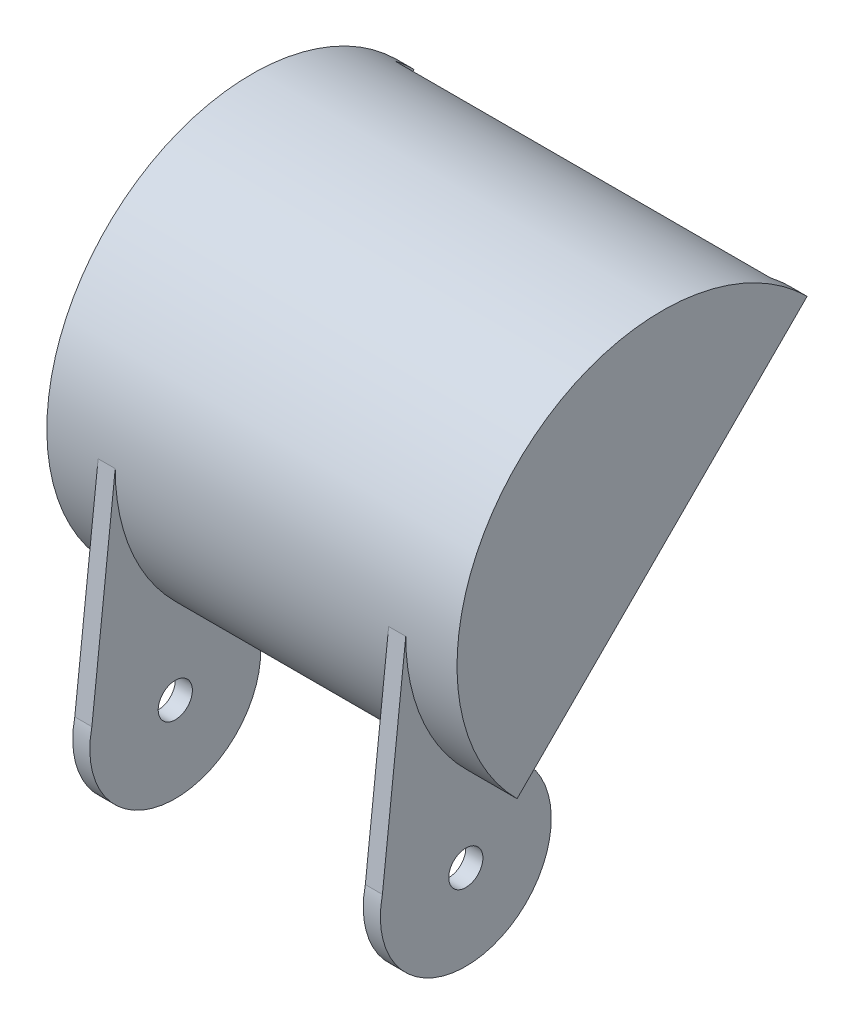
ISO-10303-21;
HEADER;
FILE_DESCRIPTION(('STEP AP214'),'2;1');
FILE_NAME('part.step','',(''),(''),'','','');
FILE_SCHEMA(('AUTOMOTIVE_DESIGN { 1 0 10303 214 1 1 1 1 }'));
ENDSEC;
DATA;
#1=APPLICATION_CONTEXT('core data for automotive mechanical design processes');
#2=APPLICATION_PROTOCOL_DEFINITION('international standard','automotive_design',2000,#1);
#3=PRODUCT_CONTEXT('',#1,'mechanical');
#4=PRODUCT('Part','Part','',(#3));
#5=PRODUCT_RELATED_PRODUCT_CATEGORY('part','',(#4));
#6=PRODUCT_DEFINITION_FORMATION('','',#4);
#7=PRODUCT_DEFINITION_CONTEXT('part definition',#1,'design');
#8=PRODUCT_DEFINITION('design','',#6,#7);
#9=PRODUCT_DEFINITION_SHAPE('','',#8);
#10=(LENGTH_UNIT() NAMED_UNIT(*) SI_UNIT(.MILLI.,.METRE.));
#11=(NAMED_UNIT(*) PLANE_ANGLE_UNIT() SI_UNIT($,.RADIAN.));
#12=(NAMED_UNIT(*) SI_UNIT($,.STERADIAN.) SOLID_ANGLE_UNIT());
#13=UNCERTAINTY_MEASURE_WITH_UNIT(LENGTH_MEASURE(1.E-05),#10,'distance_accuracy_value','');
#14=(GEOMETRIC_REPRESENTATION_CONTEXT(3) GLOBAL_UNCERTAINTY_ASSIGNED_CONTEXT((#13)) GLOBAL_UNIT_ASSIGNED_CONTEXT((#10,
#11,#12)) REPRESENTATION_CONTEXT('',''));
#15=CARTESIAN_POINT('',(0.,0.,0.));
#16=DIRECTION('',(0.,0.,1.));
#17=DIRECTION('',(1.,0.,0.));
#18=AXIS2_PLACEMENT_3D('',#15,#16,#17);
#19=CARTESIAN_POINT('',(28.575,2.24506403026729,-2.24506403026728));
#20=DIRECTION('',(0.,0.,1.));
#21=DIRECTION('',(1.,0.,0.));
#22=AXIS2_PLACEMENT_3D('',#19,#20,#21);
#23=PLANE('',#22);
#24=DIRECTION('',(0.,1.,0.));
#25=VECTOR('',#24,1.);
#26=CARTESIAN_POINT('',(-25.4,-0.15955178812898,-2.24506403026728));
#27=LINE('',#26,#25);
#28=CARTESIAN_POINT('',(-25.4,-0.15955178812898,-2.24506403026728));
#29=VERTEX_POINT('',#28);
#30=CARTESIAN_POINT('',(-25.4,2.24506403026729,-2.24506403026728));
#31=VERTEX_POINT('',#30);
#32=EDGE_CURVE('E157',#29,#31,#27,.T.);
#33=ORIENTED_EDGE('',*,*,#32,.F.);
#34=DIRECTION('',(-1.,0.,0.));
#35=VECTOR('',#34,1.);
#36=CARTESIAN_POINT('',(28.575,-0.15955178812898,-2.24506403026728));
#37=LINE('',#36,#35);
#38=CARTESIAN_POINT('',(-28.575,-0.15955178812898,-2.24506403026728));
#39=VERTEX_POINT('',#38);
#40=EDGE_CURVE('E167',#29,#39,#37,.T.);
#41=ORIENTED_EDGE('',*,*,#40,.T.);
#42=DIRECTION('',(0.,1.,0.));
#43=VECTOR('',#42,1.);
#44=CARTESIAN_POINT('',(-28.575,2.24506403026729,-2.24506403026728));
#45=LINE('',#44,#43);
#46=CARTESIAN_POINT('',(-28.575,2.24506403026729,-2.24506403026728));
#47=VERTEX_POINT('',#46);
#48=EDGE_CURVE('E352',#39,#47,#45,.T.);
#49=ORIENTED_EDGE('',*,*,#48,.T.);
#50=DIRECTION('',(-1.,0.,0.));
#51=VECTOR('',#50,1.);
#52=CARTESIAN_POINT('',(28.575,2.24506403026729,-2.24506403026728));
#53=LINE('',#52,#51);
#54=EDGE_CURVE('E53',#31,#47,#53,.T.);
#55=ORIENTED_EDGE('',*,*,#54,.F.);
#56=EDGE_LOOP('',(#33,#41,#49,#55));
#57=FACE_BOUND('',#56,.T.);
#58=ADVANCED_FACE('F37',(#57),#23,.F.);
#59=CARTESIAN_POINT('',(-75.0672223709817,26.9407683632072,11.1592316367926));
#60=DIRECTION('',(0.,0.109478882044128,0.993989121865208));
#61=DIRECTION('',(0.,-0.993989121865208,0.109478882044128));
#62=AXIS2_PLACEMENT_3D('',#59,#60,#61);
#63=PLANE('',#62);
#64=DIRECTION('',(-1.,0.,0.));
#65=VECTOR('',#64,1.);
#66=CARTESIAN_POINT('',(28.575,-12.4199390340299,15.4944563867672));
#67=LINE('',#66,#65);
#68=CARTESIAN_POINT('',(-25.4,-12.4199390340299,15.4944563867672));
#69=VERTEX_POINT('',#68);
#70=CARTESIAN_POINT('',(-28.575,-12.4199390340299,15.4944563867672));
#71=VERTEX_POINT('',#70);
#72=EDGE_CURVE('E333',#69,#71,#67,.T.);
#73=ORIENTED_EDGE('',*,*,#72,.F.);
#74=DIRECTION('',(0.,-0.993989121865208,0.109478882044128));
#75=VECTOR('',#74,1.);
#76=CARTESIAN_POINT('',(-25.4,26.9407683632072,11.1592316367926));
#77=LINE('',#76,#75);
#78=CARTESIAN_POINT('',(-25.4,26.9407683632072,11.1592316367926));
#79=VERTEX_POINT('',#78);
#80=EDGE_CURVE('E159',#79,#69,#77,.T.);
#81=ORIENTED_EDGE('',*,*,#80,.F.);
#82=DIRECTION('',(1.,0.,0.));
#83=VECTOR('',#82,1.);
#84=CARTESIAN_POINT('',(-75.0672223709817,26.9407683632072,11.1592316367926));
#85=LINE('',#84,#83);
#86=CARTESIAN_POINT('',(-28.575,26.9407683632072,11.1592316367926));
#87=VERTEX_POINT('',#86);
#88=EDGE_CURVE('E328',#87,#79,#85,.T.);
#89=ORIENTED_EDGE('',*,*,#88,.F.);
#90=DIRECTION('',(0.,0.993989121865208,-0.109478882044128));
#91=VECTOR('',#90,1.);
#92=CARTESIAN_POINT('',(-28.575,26.9407683632072,11.1592316367926));
#93=LINE('',#92,#91);
#94=EDGE_CURVE('E330',#71,#87,#93,.T.);
#95=ORIENTED_EDGE('',*,*,#94,.F.);
#96=EDGE_LOOP('',(#73,#81,#89,#95));
#97=FACE_BOUND('',#96,.T.);
#98=ADVANCED_FACE('F267',(#97),#63,.T.);
#99=CARTESIAN_POINT('',(28.575,-15.875,0.));
#100=DIRECTION('',(-1.,0.,0.));
#101=DIRECTION('',(0.,0.,1.));
#102=AXIS2_PLACEMENT_3D('',#99,#100,#101);
#103=CYLINDRICAL_SURFACE('',#102,15.875);
#104=CARTESIAN_POINT('',(-25.4,-15.875,0.));
#105=DIRECTION('',(1.,0.,0.));
#106=DIRECTION('',(0.,0.,-1.));
#107=AXIS2_PLACEMENT_3D('',#104,#105,#106);
#108=CIRCLE('',#107,15.875);
#109=EDGE_CURVE('E11',#69,#29,#108,.T.);
#110=ORIENTED_EDGE('',*,*,#109,.F.);
#111=ORIENTED_EDGE('',*,*,#72,.T.);
#112=CARTESIAN_POINT('',(-28.575,-15.875,0.));
#113=DIRECTION('',(1.,0.,0.));
#114=DIRECTION('',(0.,0.,-1.));
#115=AXIS2_PLACEMENT_3D('',#112,#113,#114);
#116=CIRCLE('',#115,15.875);
#117=EDGE_CURVE('E174',#71,#39,#116,.T.);
#118=ORIENTED_EDGE('',*,*,#117,.T.);
#119=ORIENTED_EDGE('',*,*,#40,.F.);
#120=EDGE_LOOP('',(#110,#111,#118,#119));
#121=FACE_BOUND('',#120,.T.);
#122=ADVANCED_FACE('F172',(#121),#103,.T.);
#123=CARTESIAN_POINT('',(38.1,0.,0.));
#124=DIRECTION('',(0.,0.707106781186546,0.707106781186549));
#125=DIRECTION('',(0.,-0.707106781186549,0.707106781186546));
#126=AXIS2_PLACEMENT_3D('',#123,#124,#125);
#127=PLANE('',#126);
#128=DIRECTION('',(0.,-0.707106781186549,0.707106781186546));
#129=VECTOR('',#128,1.);
#130=CARTESIAN_POINT('',(-28.575,2.24506403026729,-2.24506403026728));
#131=LINE('',#130,#129);
#132=CARTESIAN_POINT('',(-28.575,0.,0.));
#133=VERTEX_POINT('',#132);
#134=EDGE_CURVE('E248',#47,#133,#131,.T.);
#135=ORIENTED_EDGE('',*,*,#134,.T.);
#136=DIRECTION('',(-1.,0.,0.));
#137=VECTOR('',#136,1.);
#138=CARTESIAN_POINT('',(38.1,0.,0.));
#139=LINE('',#138,#137);
#140=CARTESIAN_POINT('',(-38.1,0.,0.));
#141=VERTEX_POINT('',#140);
#142=EDGE_CURVE('E210',#133,#141,#139,.T.);
#143=ORIENTED_EDGE('',*,*,#142,.T.);
#144=DIRECTION('',(0.,0.707106781186549,-0.707106781186546));
#145=VECTOR('',#144,1.);
#146=CARTESIAN_POINT('',(-38.1,0.,0.));
#147=LINE('',#146,#145);
#148=CARTESIAN_POINT('',(-38.1,53.881536726415,-53.8815367264148));
#149=VERTEX_POINT('',#148);
#150=EDGE_CURVE('E200',#141,#149,#147,.T.);
#151=ORIENTED_EDGE('',*,*,#150,.T.);
#152=DIRECTION('',(-1.,0.,0.));
#153=VECTOR('',#152,1.);
#154=CARTESIAN_POINT('',(38.1,53.881536726415,-53.8815367264148));
#155=LINE('',#154,#153);
#156=CARTESIAN_POINT('',(-34.925,53.881536726415,-53.8815367264148));
#157=VERTEX_POINT('',#156);
#158=EDGE_CURVE('E202',#157,#149,#155,.T.);
#159=ORIENTED_EDGE('',*,*,#158,.F.);
#160=DIRECTION('',(0.,0.707106781186549,-0.707106781186546));
#161=VECTOR('',#160,1.);
#162=CARTESIAN_POINT('',(-34.925,0.,0.));
#163=LINE('',#162,#161);
#164=CARTESIAN_POINT('',(-34.925,2.24506403026729,-2.24506403026728));
#165=VERTEX_POINT('',#164);
#166=EDGE_CURVE('E186',#165,#157,#163,.T.);
#167=ORIENTED_EDGE('',*,*,#166,.F.);
#168=DIRECTION('',(-1.,0.,0.));
#169=VECTOR('',#168,1.);
#170=CARTESIAN_POINT('',(34.925,2.24506403026729,-2.24506403026728));
#171=LINE('',#170,#169);
#172=EDGE_CURVE('E193',#47,#165,#171,.T.);
#173=ORIENTED_EDGE('',*,*,#172,.F.);
#174=EDGE_LOOP('',(#135,#143,#151,#159,#167,#173));
#175=FACE_BOUND('',#174,.T.);
#176=ADVANCED_FACE('F247',(#175),#127,.F.);
#177=CARTESIAN_POINT('',(38.1,0.,0.));
#178=VERTEX_POINT('',#177);
#179=CARTESIAN_POINT('',(28.575,0.,0.));
#180=VERTEX_POINT('',#179);
#181=EDGE_CURVE('E211',#178,#180,#139,.T.);
#182=ORIENTED_EDGE('',*,*,#181,.T.);
#183=DIRECTION('',(0.,-0.707106781186549,0.707106781186546));
#184=VECTOR('',#183,1.);
#185=CARTESIAN_POINT('',(28.575,2.24506403026729,-2.24506403026728));
#186=LINE('',#185,#184);
#187=CARTESIAN_POINT('',(28.575,2.24506403026729,-2.24506403026728));
#188=VERTEX_POINT('',#187);
#189=EDGE_CURVE('E349',#188,#180,#186,.T.);
#190=ORIENTED_EDGE('',*,*,#189,.F.);
#191=CARTESIAN_POINT('',(34.925,2.24506403026729,-2.24506403026728));
#192=VERTEX_POINT('',#191);
#193=EDGE_CURVE('E189',#192,#188,#171,.T.);
#194=ORIENTED_EDGE('',*,*,#193,.F.);
#195=DIRECTION('',(0.,0.707106781186549,-0.707106781186546));
#196=VECTOR('',#195,1.);
#197=CARTESIAN_POINT('',(34.925,0.,0.));
#198=LINE('',#197,#196);
#199=CARTESIAN_POINT('',(34.925,53.881536726415,-53.8815367264148));
#200=VERTEX_POINT('',#199);
#201=EDGE_CURVE('E61',#192,#200,#198,.T.);
#202=ORIENTED_EDGE('',*,*,#201,.T.);
#203=CARTESIAN_POINT('',(38.1,53.881536726415,-53.8815367264148));
#204=VERTEX_POINT('',#203);
#205=EDGE_CURVE('E207',#204,#200,#155,.T.);
#206=ORIENTED_EDGE('',*,*,#205,.F.);
#207=DIRECTION('',(0.,0.707106781186549,-0.707106781186546));
#208=VECTOR('',#207,1.);
#209=CARTESIAN_POINT('',(38.1,0.,0.));
#210=LINE('',#209,#208);
#211=EDGE_CURVE('E199',#178,#204,#210,.T.);
#212=ORIENTED_EDGE('',*,*,#211,.F.);
#213=EDGE_LOOP('',(#182,#190,#194,#202,#206,#212));
#214=FACE_BOUND('',#213,.T.);
#215=ADVANCED_FACE('F370',(#214),#127,.F.);
#216=CARTESIAN_POINT('',(38.1,26.9407683632075,-26.9407683632074));
#217=DIRECTION('',(-1.,0.,0.));
#218=DIRECTION('',(0.,0.,1.));
#219=AXIS2_PLACEMENT_3D('',#216,#217,#218);
#220=CYLINDRICAL_SURFACE('',#219,38.1);
#221=ORIENTED_EDGE('',*,*,#88,.T.);
#222=CARTESIAN_POINT('',(-25.4,26.9407683632075,-26.9407683632074));
#223=DIRECTION('',(-1.,0.,0.));
#224=DIRECTION('',(0.,0.,-1.));
#225=AXIS2_PLACEMENT_3D('',#222,#223,#224);
#226=CIRCLE('',#225,38.1);
#227=CARTESIAN_POINT('',(-25.4,0.,0.));
#228=VERTEX_POINT('',#227);
#229=EDGE_CURVE('E359',#228,#79,#226,.T.);
#230=ORIENTED_EDGE('',*,*,#229,.F.);
#231=DIRECTION('',(1.,0.,0.));
#232=VECTOR('',#231,1.);
#233=CARTESIAN_POINT('',(-25.4,0.,0.));
#234=LINE('',#233,#232);
#235=CARTESIAN_POINT('',(25.4,0.,0.));
#236=VERTEX_POINT('',#235);
#237=EDGE_CURVE('E320',#228,#236,#234,.T.);
#238=ORIENTED_EDGE('',*,*,#237,.T.);
#239=CARTESIAN_POINT('',(25.4,26.9407683632075,-26.9407683632074));
#240=DIRECTION('',(-1.,0.,0.));
#241=DIRECTION('',(0.,0.,-1.));
#242=AXIS2_PLACEMENT_3D('',#239,#240,#241);
#243=CIRCLE('',#242,38.1);
#244=CARTESIAN_POINT('',(25.4,26.9407683632072,11.1592316367926));
#245=VERTEX_POINT('',#244);
#246=EDGE_CURVE('E313',#236,#245,#243,.T.);
#247=ORIENTED_EDGE('',*,*,#246,.T.);
#248=CARTESIAN_POINT('',(28.575,26.9407683632072,11.1592316367926));
#249=VERTEX_POINT('',#248);
#250=EDGE_CURVE('E327',#245,#249,#85,.T.);
#251=ORIENTED_EDGE('',*,*,#250,.T.);
#252=CARTESIAN_POINT('',(28.575,26.9407683632075,-26.9407683632074));
#253=DIRECTION('',(1.,0.,0.));
#254=DIRECTION('',(0.,0.,-1.));
#255=AXIS2_PLACEMENT_3D('',#252,#253,#254);
#256=CIRCLE('',#255,38.1);
#257=EDGE_CURVE('E335',#249,#180,#256,.T.);
#258=ORIENTED_EDGE('',*,*,#257,.T.);
#259=ORIENTED_EDGE('',*,*,#181,.F.);
#260=CARTESIAN_POINT('',(38.1,26.9407683632075,-26.9407683632074));
#261=DIRECTION('',(1.,0.,0.));
#262=DIRECTION('',(0.,0.,-1.));
#263=AXIS2_PLACEMENT_3D('',#260,#261,#262);
#264=CIRCLE('',#263,38.1);
#265=EDGE_CURVE('E196',#204,#178,#264,.T.);
#266=ORIENTED_EDGE('',*,*,#265,.F.);
#267=ORIENTED_EDGE('',*,*,#205,.T.);
#268=CARTESIAN_POINT('',(34.925,26.9407683632075,-26.9407683632074));
#269=DIRECTION('',(1.,0.,0.));
#270=DIRECTION('',(0.,0.,-1.));
#271=AXIS2_PLACEMENT_3D('',#268,#269,#270);
#272=CIRCLE('',#271,38.1);
#273=CARTESIAN_POINT('',(34.925,57.0511320390414,-50.2854893790821));
#274=VERTEX_POINT('',#273);
#275=EDGE_CURVE('E214',#200,#274,#272,.T.);
#276=ORIENTED_EDGE('',*,*,#275,.T.);
#277=DIRECTION('',(-1.,0.,0.));
#278=VECTOR('',#277,1.);
#279=CARTESIAN_POINT('',(0.,57.0511320390414,-50.2854893790821));
#280=LINE('',#279,#278);
#281=CARTESIAN_POINT('',(-34.925,57.0511320390414,-50.2854893790821));
#282=VERTEX_POINT('',#281);
#283=EDGE_CURVE('E217',#274,#282,#280,.T.);
#284=ORIENTED_EDGE('',*,*,#283,.T.);
#285=CARTESIAN_POINT('',(-34.925,26.9407683632075,-26.9407683632074));
#286=DIRECTION('',(1.,0.,0.));
#287=DIRECTION('',(0.,0.,-1.));
#288=AXIS2_PLACEMENT_3D('',#285,#286,#287);
#289=CIRCLE('',#288,38.1);
#290=EDGE_CURVE('E220',#282,#157,#289,.F.);
#291=ORIENTED_EDGE('',*,*,#290,.T.);
#292=ORIENTED_EDGE('',*,*,#158,.T.);
#293=CARTESIAN_POINT('',(-38.1,26.9407683632075,-26.9407683632074));
#294=DIRECTION('',(1.,0.,0.));
#295=DIRECTION('',(0.,0.,-1.));
#296=AXIS2_PLACEMENT_3D('',#293,#294,#295);
#297=CIRCLE('',#296,38.1);
#298=EDGE_CURVE('E192',#149,#141,#297,.T.);
#299=ORIENTED_EDGE('',*,*,#298,.T.);
#300=ORIENTED_EDGE('',*,*,#142,.F.);
#301=CARTESIAN_POINT('',(-28.575,26.9407683632075,-26.9407683632074));
#302=DIRECTION('',(1.,0.,0.));
#303=DIRECTION('',(0.,0.,-1.));
#304=AXIS2_PLACEMENT_3D('',#301,#302,#303);
#305=CIRCLE('',#304,38.1);
#306=EDGE_CURVE('E337',#87,#133,#305,.T.);
#307=ORIENTED_EDGE('',*,*,#306,.F.);
#308=EDGE_LOOP('',(#221,#230,#238,#247,#251,#258,#259,#266,#267,#276,#284,#291,#292,#299,#300,#307));
#309=FACE_BOUND('',#308,.T.);
#310=ADVANCED_FACE('F236',(#309),#220,.T.);
#311=CARTESIAN_POINT('',(38.1,26.9407683632075,-26.9407683632074));
#312=DIRECTION('',(1.,0.,0.));
#313=DIRECTION('',(0.,0.,-1.));
#314=AXIS2_PLACEMENT_3D('',#311,#312,#313);
#315=PLANE('',#314);
#316=ORIENTED_EDGE('',*,*,#265,.T.);
#317=ORIENTED_EDGE('',*,*,#211,.T.);
#318=EDGE_LOOP('',(#316,#317));
#319=FACE_BOUND('',#318,.T.);
#320=ADVANCED_FACE('F256',(#319),#315,.T.);
#321=CARTESIAN_POINT('',(-38.1,26.9407683632075,-26.9407683632074));
#322=DIRECTION('',(1.,0.,0.));
#323=DIRECTION('',(0.,0.,-1.));
#324=AXIS2_PLACEMENT_3D('',#321,#322,#323);
#325=PLANE('',#324);
#326=ORIENTED_EDGE('',*,*,#298,.F.);
#327=ORIENTED_EDGE('',*,*,#150,.F.);
#328=EDGE_LOOP('',(#326,#327));
#329=FACE_BOUND('',#328,.T.);
#330=ADVANCED_FACE('F254',(#329),#325,.F.);
#331=CARTESIAN_POINT('',(38.1,26.9407683632075,-26.9407683632074));
#332=DIRECTION('',(-1.,0.,0.));
#333=DIRECTION('',(0.,0.,1.));
#334=AXIS2_PLACEMENT_3D('',#331,#332,#333);
#335=CYLINDRICAL_SURFACE('',#334,34.925);
#336=ORIENTED_EDGE('',*,*,#193,.T.);
#337=CARTESIAN_POINT('',(25.4,2.24506403026729,-2.24506403026728));
#338=VERTEX_POINT('',#337);
#339=EDGE_CURVE('E176',#188,#338,#53,.T.);
#340=ORIENTED_EDGE('',*,*,#339,.T.);
#341=DIRECTION('',(1.,0.,0.));
#342=VECTOR('',#341,1.);
#343=CARTESIAN_POINT('',(-25.4,2.24506403026729,-2.24506403026728));
#344=LINE('',#343,#342);
#345=EDGE_CURVE('E323',#31,#338,#344,.T.);
#346=ORIENTED_EDGE('',*,*,#345,.F.);
#347=ORIENTED_EDGE('',*,*,#54,.T.);
#348=ORIENTED_EDGE('',*,*,#172,.T.);
#349=CARTESIAN_POINT('',(-34.925,26.9407683632075,-26.9407683632074));
#350=DIRECTION('',(1.,0.,0.));
#351=DIRECTION('',(0.,0.,-1.));
#352=AXIS2_PLACEMENT_3D('',#349,#350,#351);
#353=CIRCLE('',#352,34.925);
#354=CARTESIAN_POINT('',(-34.925,56.513988483178,-45.5197962370164));
#355=VERTEX_POINT('',#354);
#356=EDGE_CURVE('E179',#355,#165,#353,.T.);
#357=ORIENTED_EDGE('',*,*,#356,.F.);
#358=DIRECTION('',(-1.,0.,0.));
#359=VECTOR('',#358,1.);
#360=CARTESIAN_POINT('',(38.1,56.513988483178,-45.5197962370164));
#361=LINE('',#360,#359);
#362=CARTESIAN_POINT('',(34.925,56.513988483178,-45.5197962370164));
#363=VERTEX_POINT('',#362);
#364=EDGE_CURVE('E223',#355,#363,#361,.F.);
#365=ORIENTED_EDGE('',*,*,#364,.T.);
#366=CARTESIAN_POINT('',(34.925,26.9407683632075,-26.9407683632074));
#367=DIRECTION('',(1.,0.,0.));
#368=DIRECTION('',(0.,0.,-1.));
#369=AXIS2_PLACEMENT_3D('',#366,#367,#368);
#370=CIRCLE('',#369,34.925);
#371=EDGE_CURVE('E187',#363,#192,#370,.T.);
#372=ORIENTED_EDGE('',*,*,#371,.T.);
#373=EDGE_LOOP('',(#336,#340,#346,#347,#348,#357,#365,#372));
#374=FACE_BOUND('',#373,.T.);
#375=ADVANCED_FACE('F243',(#374),#335,.F.);
#376=CARTESIAN_POINT('',(34.925,26.9407683632075,-26.9407683632074));
#377=DIRECTION('',(1.,0.,0.));
#378=DIRECTION('',(0.,0.,-1.));
#379=AXIS2_PLACEMENT_3D('',#376,#377,#378);
#380=PLANE('',#379);
#381=ORIENTED_EDGE('',*,*,#371,.F.);
#382=DIRECTION('',(0.,-0.11200131110685,0.993708058893731));
#383=VECTOR('',#382,1.);
#384=CARTESIAN_POINT('',(34.925,54.0752305896627,-23.8824301336417));
#385=LINE('',#384,#383);
#386=EDGE_CURVE('E46',#363,#274,#385,.F.);
#387=ORIENTED_EDGE('',*,*,#386,.T.);
#388=ORIENTED_EDGE('',*,*,#275,.F.);
#389=ORIENTED_EDGE('',*,*,#201,.F.);
#390=EDGE_LOOP('',(#381,#387,#388,#389));
#391=FACE_BOUND('',#390,.T.);
#392=ADVANCED_FACE('F230',(#391),#380,.F.);
#393=CARTESIAN_POINT('',(-34.925,26.9407683632075,-26.9407683632074));
#394=DIRECTION('',(1.,0.,0.));
#395=DIRECTION('',(0.,0.,-1.));
#396=AXIS2_PLACEMENT_3D('',#393,#394,#395);
#397=PLANE('',#396);
#398=ORIENTED_EDGE('',*,*,#166,.T.);
#399=ORIENTED_EDGE('',*,*,#290,.F.);
#400=DIRECTION('',(0.,0.11200131110685,-0.993708058893731));
#401=VECTOR('',#400,1.);
#402=CARTESIAN_POINT('',(-34.925,57.9105570692999,-57.9105570692997));
#403=LINE('',#402,#401);
#404=EDGE_CURVE('E226',#282,#355,#403,.F.);
#405=ORIENTED_EDGE('',*,*,#404,.T.);
#406=ORIENTED_EDGE('',*,*,#356,.T.);
#407=EDGE_LOOP('',(#398,#399,#405,#406));
#408=FACE_BOUND('',#407,.T.);
#409=ADVANCED_FACE('F241',(#408),#397,.T.);
#410=CARTESIAN_POINT('',(38.1,57.9105570692999,-57.9105570692997));
#411=DIRECTION('',(0.,0.993708058893731,0.11200131110685));
#412=DIRECTION('',(-1.,0.,0.));
#413=AXIS2_PLACEMENT_3D('',#410,#411,#412);
#414=PLANE('',#413);
#415=ORIENTED_EDGE('',*,*,#386,.F.);
#416=ORIENTED_EDGE('',*,*,#364,.F.);
#417=ORIENTED_EDGE('',*,*,#404,.F.);
#418=ORIENTED_EDGE('',*,*,#283,.F.);
#419=EDGE_LOOP('',(#415,#416,#417,#418));
#420=FACE_BOUND('',#419,.T.);
#421=ADVANCED_FACE('F39',(#420),#414,.F.);
#422=CARTESIAN_POINT('',(28.575,-0.159551788128983,-2.24506403026728));
#423=VERTEX_POINT('',#422);
#424=CARTESIAN_POINT('',(25.4,-0.15955178812898,-2.24506403026728));
#425=VERTEX_POINT('',#424);
#426=EDGE_CURVE('E175',#423,#425,#37,.T.);
#427=ORIENTED_EDGE('',*,*,#426,.T.);
#428=DIRECTION('',(0.,1.,0.));
#429=VECTOR('',#428,1.);
#430=CARTESIAN_POINT('',(25.4,-0.15955178812898,-2.24506403026728));
#431=LINE('',#430,#429);
#432=EDGE_CURVE('E292',#425,#338,#431,.T.);
#433=ORIENTED_EDGE('',*,*,#432,.T.);
#434=ORIENTED_EDGE('',*,*,#339,.F.);
#435=DIRECTION('',(0.,1.,0.));
#436=VECTOR('',#435,1.);
#437=CARTESIAN_POINT('',(28.575,2.24506403026729,-2.24506403026728));
#438=LINE('',#437,#436);
#439=EDGE_CURVE('E293',#423,#188,#438,.T.);
#440=ORIENTED_EDGE('',*,*,#439,.F.);
#441=EDGE_LOOP('',(#427,#433,#434,#440));
#442=FACE_BOUND('',#441,.T.);
#443=ADVANCED_FACE('F269',(#442),#23,.F.);
#444=CARTESIAN_POINT('',(28.575,0.,0.));
#445=DIRECTION('',(1.,0.,0.));
#446=DIRECTION('',(0.,0.,-1.));
#447=AXIS2_PLACEMENT_3D('',#444,#445,#446);
#448=PLANE('',#447);
#449=CARTESIAN_POINT('',(28.575,-15.875,0.));
#450=DIRECTION('',(1.,0.,0.));
#451=DIRECTION('',(0.,0.,-1.));
#452=AXIS2_PLACEMENT_3D('',#449,#450,#451);
#453=CIRCLE('',#452,15.875);
#454=CARTESIAN_POINT('',(28.575,-12.4199390340299,15.4944563867672));
#455=VERTEX_POINT('',#454);
#456=EDGE_CURVE('E298',#455,#423,#453,.T.);
#457=ORIENTED_EDGE('',*,*,#456,.T.);
#458=ORIENTED_EDGE('',*,*,#439,.T.);
#459=ORIENTED_EDGE('',*,*,#189,.T.);
#460=ORIENTED_EDGE('',*,*,#257,.F.);
#461=DIRECTION('',(0.,-0.993989121865208,0.109478882044128));
#462=VECTOR('',#461,1.);
#463=CARTESIAN_POINT('',(28.575,26.9407683632072,11.1592316367926));
#464=LINE('',#463,#462);
#465=EDGE_CURVE('E322',#249,#455,#464,.T.);
#466=ORIENTED_EDGE('',*,*,#465,.T.);
#467=EDGE_LOOP('',(#457,#458,#459,#460,#466));
#468=FACE_BOUND('',#467,.T.);
#469=CARTESIAN_POINT('',(28.575,-15.875,0.));
#470=DIRECTION('',(1.,0.,0.));
#471=DIRECTION('',(0.,0.,-1.));
#472=AXIS2_PLACEMENT_3D('',#469,#470,#471);
#473=CIRCLE('',#472,3.175);
#474=CARTESIAN_POINT('',(28.575,-15.875,-3.175));
#475=VERTEX_POINT('',#474);
#476=EDGE_CURVE('E342',#475,#475,#473,.F.);
#477=ORIENTED_EDGE('',*,*,#476,.T.);
#478=EDGE_LOOP('',(#477));
#479=FACE_BOUND('',#478,.T.);
#480=ADVANCED_FACE('F278',(#468,#479),#448,.T.);
#481=CARTESIAN_POINT('',(-28.575,0.,0.));
#482=DIRECTION('',(1.,0.,0.));
#483=DIRECTION('',(0.,0.,-1.));
#484=AXIS2_PLACEMENT_3D('',#481,#482,#483);
#485=PLANE('',#484);
#486=ORIENTED_EDGE('',*,*,#117,.F.);
#487=ORIENTED_EDGE('',*,*,#94,.T.);
#488=ORIENTED_EDGE('',*,*,#306,.T.);
#489=ORIENTED_EDGE('',*,*,#134,.F.);
#490=ORIENTED_EDGE('',*,*,#48,.F.);
#491=EDGE_LOOP('',(#486,#487,#488,#489,#490));
#492=FACE_BOUND('',#491,.T.);
#493=CARTESIAN_POINT('',(-28.575,-15.875,0.));
#494=DIRECTION('',(-1.,0.,0.));
#495=DIRECTION('',(0.,0.,1.));
#496=AXIS2_PLACEMENT_3D('',#493,#494,#495);
#497=CIRCLE('',#496,3.175);
#498=CARTESIAN_POINT('',(-28.575,-15.875,3.175));
#499=VERTEX_POINT('',#498);
#500=EDGE_CURVE('E339',#499,#499,#497,.T.);
#501=ORIENTED_EDGE('',*,*,#500,.F.);
#502=EDGE_LOOP('',(#501));
#503=FACE_BOUND('',#502,.T.);
#504=ADVANCED_FACE('F284',(#492,#503),#485,.F.);
#505=ORIENTED_EDGE('',*,*,#456,.F.);
#506=DIRECTION('',(-1.,0.,0.));
#507=VECTOR('',#506,1.);
#508=CARTESIAN_POINT('',(28.575,-12.4199390340299,15.4944563867672));
#509=LINE('',#508,#507);
#510=CARTESIAN_POINT('',(25.4,-12.4199390340299,15.4944563867672));
#511=VERTEX_POINT('',#510);
#512=EDGE_CURVE('E301',#455,#511,#509,.T.);
#513=ORIENTED_EDGE('',*,*,#512,.T.);
#514=CARTESIAN_POINT('',(25.4,-15.875,0.));
#515=DIRECTION('',(1.,0.,0.));
#516=DIRECTION('',(0.,0.,-1.));
#517=AXIS2_PLACEMENT_3D('',#514,#515,#516);
#518=CIRCLE('',#517,15.875);
#519=EDGE_CURVE('E300',#511,#425,#518,.T.);
#520=ORIENTED_EDGE('',*,*,#519,.T.);
#521=ORIENTED_EDGE('',*,*,#426,.F.);
#522=EDGE_LOOP('',(#505,#513,#520,#521));
#523=FACE_BOUND('',#522,.T.);
#524=ADVANCED_FACE('F296',(#523),#103,.T.);
#525=CARTESIAN_POINT('',(-25.4,-15.875,0.));
#526=DIRECTION('',(1.,0.,0.));
#527=DIRECTION('',(0.,0.,-1.));
#528=AXIS2_PLACEMENT_3D('',#525,#526,#527);
#529=PLANE('',#528);
#530=ORIENTED_EDGE('',*,*,#109,.T.);
#531=ORIENTED_EDGE('',*,*,#32,.T.);
#532=DIRECTION('',(0.,-0.707106781186549,0.707106781186546));
#533=VECTOR('',#532,1.);
#534=CARTESIAN_POINT('',(-25.4,2.24506403026729,-2.24506403026728));
#535=LINE('',#534,#533);
#536=EDGE_CURVE('E169',#31,#228,#535,.T.);
#537=ORIENTED_EDGE('',*,*,#536,.T.);
#538=ORIENTED_EDGE('',*,*,#229,.T.);
#539=ORIENTED_EDGE('',*,*,#80,.T.);
#540=EDGE_LOOP('',(#530,#531,#537,#538,#539));
#541=FACE_BOUND('',#540,.T.);
#542=CARTESIAN_POINT('',(-25.4,-15.875,0.));
#543=DIRECTION('',(1.,0.,0.));
#544=DIRECTION('',(0.,0.,-1.));
#545=AXIS2_PLACEMENT_3D('',#542,#543,#544);
#546=CIRCLE('',#545,3.175);
#547=CARTESIAN_POINT('',(-25.4,-15.875,-3.175));
#548=VERTEX_POINT('',#547);
#549=EDGE_CURVE('E304',#548,#548,#546,.T.);
#550=ORIENTED_EDGE('',*,*,#549,.F.);
#551=EDGE_LOOP('',(#550));
#552=FACE_BOUND('',#551,.T.);
#553=ADVANCED_FACE('F154',(#541,#552),#529,.T.);
#554=CARTESIAN_POINT('',(25.4,-15.875,0.));
#555=DIRECTION('',(1.,0.,0.));
#556=DIRECTION('',(0.,0.,-1.));
#557=AXIS2_PLACEMENT_3D('',#554,#555,#556);
#558=PLANE('',#557);
#559=ORIENTED_EDGE('',*,*,#519,.F.);
#560=DIRECTION('',(0.,-0.993989121865208,0.109478882044128));
#561=VECTOR('',#560,1.);
#562=CARTESIAN_POINT('',(25.4,26.9407683632072,11.1592316367926));
#563=LINE('',#562,#561);
#564=EDGE_CURVE('E170',#245,#511,#563,.T.);
#565=ORIENTED_EDGE('',*,*,#564,.F.);
#566=ORIENTED_EDGE('',*,*,#246,.F.);
#567=DIRECTION('',(0.,-0.707106781186549,0.707106781186546));
#568=VECTOR('',#567,1.);
#569=CARTESIAN_POINT('',(25.4,2.24506403026729,-2.24506403026728));
#570=LINE('',#569,#568);
#571=EDGE_CURVE('E311',#338,#236,#570,.T.);
#572=ORIENTED_EDGE('',*,*,#571,.F.);
#573=ORIENTED_EDGE('',*,*,#432,.F.);
#574=EDGE_LOOP('',(#559,#565,#566,#572,#573));
#575=FACE_BOUND('',#574,.T.);
#576=CARTESIAN_POINT('',(25.4,-15.875,0.));
#577=DIRECTION('',(1.,0.,0.));
#578=DIRECTION('',(0.,0.,-1.));
#579=AXIS2_PLACEMENT_3D('',#576,#577,#578);
#580=CIRCLE('',#579,3.175);
#581=CARTESIAN_POINT('',(25.4,-15.875,-3.175));
#582=VERTEX_POINT('',#581);
#583=EDGE_CURVE('E41',#582,#582,#580,.T.);
#584=ORIENTED_EDGE('',*,*,#583,.T.);
#585=EDGE_LOOP('',(#584));
#586=FACE_BOUND('',#585,.T.);
#587=ADVANCED_FACE('F307',(#575,#586),#558,.F.);
#588=CARTESIAN_POINT('',(37.5552561210691,-15.875,0.));
#589=DIRECTION('',(-1.,0.,0.));
#590=DIRECTION('',(0.,0.,1.));
#591=AXIS2_PLACEMENT_3D('',#588,#589,#590);
#592=CYLINDRICAL_SURFACE('',#591,3.175);
#593=ORIENTED_EDGE('',*,*,#476,.F.);
#594=EDGE_LOOP('',(#593));
#595=FACE_BOUND('',#594,.T.);
#596=ORIENTED_EDGE('',*,*,#583,.F.);
#597=EDGE_LOOP('',(#596));
#598=FACE_BOUND('',#597,.T.);
#599=ADVANCED_FACE('F417',(#595,#598),#592,.F.);
#600=ORIENTED_EDGE('',*,*,#549,.T.);
#601=EDGE_LOOP('',(#600));
#602=FACE_BOUND('',#601,.T.);
#603=ORIENTED_EDGE('',*,*,#500,.T.);
#604=EDGE_LOOP('',(#603));
#605=FACE_BOUND('',#604,.T.);
#606=ADVANCED_FACE('F413',(#602,#605),#592,.F.);
#607=ORIENTED_EDGE('',*,*,#564,.T.);
#608=ORIENTED_EDGE('',*,*,#512,.F.);
#609=ORIENTED_EDGE('',*,*,#465,.F.);
#610=ORIENTED_EDGE('',*,*,#250,.F.);
#611=EDGE_LOOP('',(#607,#608,#609,#610));
#612=FACE_BOUND('',#611,.T.);
#613=ADVANCED_FACE('F275',(#612),#63,.T.);
#614=CARTESIAN_POINT('',(-25.4,2.24506403026729,-2.24506403026728));
#615=DIRECTION('',(0.,0.707106781186546,0.707106781186549));
#616=DIRECTION('',(0.,-0.707106781186549,0.707106781186546));
#617=AXIS2_PLACEMENT_3D('',#614,#615,#616);
#618=PLANE('',#617);
#619=ORIENTED_EDGE('',*,*,#571,.T.);
#620=ORIENTED_EDGE('',*,*,#237,.F.);
#621=ORIENTED_EDGE('',*,*,#536,.F.);
#622=ORIENTED_EDGE('',*,*,#345,.T.);
#623=EDGE_LOOP('',(#619,#620,#621,#622));
#624=FACE_BOUND('',#623,.T.);
#625=ADVANCED_FACE('F362',(#624),#618,.F.);
#626=CLOSED_SHELL('',(#58,#98,#122,#176,#215,#310,#320,#330,#375,#392,#409,#421,#443,#480,#504,
#524,#553,#587,#599,#606,#613,#625));
#627=MANIFOLD_SOLID_BREP('B2',#626);
#628=ADVANCED_BREP_SHAPE_REPRESENTATION('',(#18,#627),#14);
#629=SHAPE_DEFINITION_REPRESENTATION(#9,#628);
ENDSEC;
END-ISO-10303-21;
